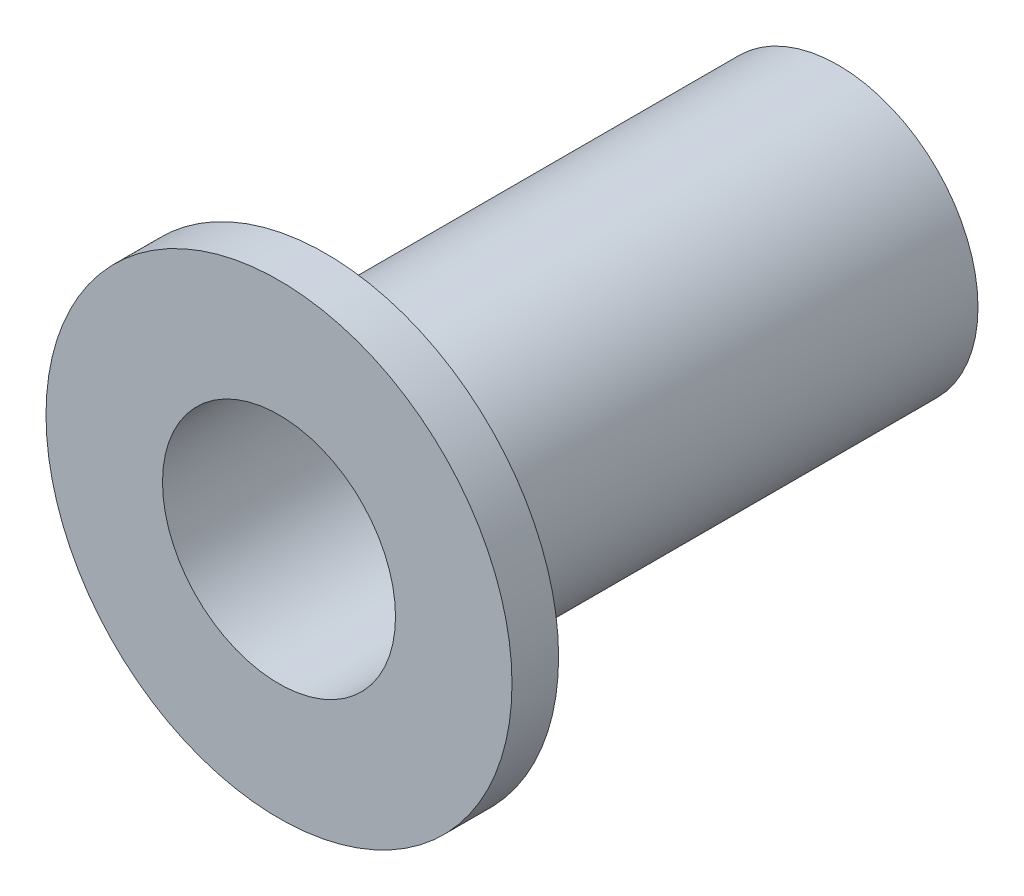
ISO-10303-21;
HEADER;
FILE_DESCRIPTION(('STEP AP214'),'2;1');
FILE_NAME('part.step','',(''),(''),'','','');
FILE_SCHEMA(('AUTOMOTIVE_DESIGN { 1 0 10303 214 1 1 1 1 }'));
ENDSEC;
DATA;
#1=APPLICATION_CONTEXT('core data for automotive mechanical design processes');
#2=APPLICATION_PROTOCOL_DEFINITION('international standard','automotive_design',2000,#1);
#3=PRODUCT_CONTEXT('',#1,'mechanical');
#4=PRODUCT('Part','Part','',(#3));
#5=PRODUCT_RELATED_PRODUCT_CATEGORY('part','',(#4));
#6=PRODUCT_DEFINITION_FORMATION('','',#4);
#7=PRODUCT_DEFINITION_CONTEXT('part definition',#1,'design');
#8=PRODUCT_DEFINITION('design','',#6,#7);
#9=PRODUCT_DEFINITION_SHAPE('','',#8);
#10=(LENGTH_UNIT() NAMED_UNIT(*) SI_UNIT(.MILLI.,.METRE.));
#11=(NAMED_UNIT(*) PLANE_ANGLE_UNIT() SI_UNIT($,.RADIAN.));
#12=(NAMED_UNIT(*) SI_UNIT($,.STERADIAN.) SOLID_ANGLE_UNIT());
#13=UNCERTAINTY_MEASURE_WITH_UNIT(LENGTH_MEASURE(1.E-05),#10,'distance_accuracy_value','');
#14=(GEOMETRIC_REPRESENTATION_CONTEXT(3) GLOBAL_UNCERTAINTY_ASSIGNED_CONTEXT((#13)) GLOBAL_UNIT_ASSIGNED_CONTEXT((#10,
#11,#12)) REPRESENTATION_CONTEXT('',''));
#15=CARTESIAN_POINT('',(0.,0.,0.));
#16=DIRECTION('',(0.,0.,1.));
#17=DIRECTION('',(1.,0.,0.));
#18=AXIS2_PLACEMENT_3D('',#15,#16,#17);
#19=CARTESIAN_POINT('',(0.,0.,6.));
#20=DIRECTION('',(0.,0.,-1.));
#21=DIRECTION('',(-1.,0.,0.));
#22=AXIS2_PLACEMENT_3D('',#19,#20,#21);
#23=CYLINDRICAL_SURFACE('',#22,1.5);
#24=CARTESIAN_POINT('',(0.,0.,0.));
#25=DIRECTION('',(0.,0.,1.));
#26=DIRECTION('',(1.,0.,0.));
#27=AXIS2_PLACEMENT_3D('',#24,#25,#26);
#28=CIRCLE('',#27,1.5);
#29=CARTESIAN_POINT('',(1.5,0.,0.));
#30=VERTEX_POINT('',#29);
#31=EDGE_CURVE('E33',#30,#30,#28,.T.);
#32=ORIENTED_EDGE('',*,*,#31,.T.);
#33=EDGE_LOOP('',(#32));
#34=FACE_BOUND('',#33,.T.);
#35=CARTESIAN_POINT('',(0.,0.,5.5));
#36=DIRECTION('',(0.,0.,1.));
#37=DIRECTION('',(1.,0.,0.));
#38=AXIS2_PLACEMENT_3D('',#35,#36,#37);
#39=CIRCLE('',#38,1.5);
#40=CARTESIAN_POINT('',(1.5,0.,5.5));
#41=VERTEX_POINT('',#40);
#42=EDGE_CURVE('E10',#41,#41,#39,.T.);
#43=ORIENTED_EDGE('',*,*,#42,.F.);
#44=EDGE_LOOP('',(#43));
#45=FACE_BOUND('',#44,.T.);
#46=ADVANCED_FACE('F30',(#34,#45),#23,.T.);
#47=CARTESIAN_POINT('',(0.,0.,6.));
#48=DIRECTION('',(0.,0.,1.));
#49=DIRECTION('',(1.,0.,0.));
#50=AXIS2_PLACEMENT_3D('',#47,#48,#49);
#51=PLANE('',#50);
#52=CARTESIAN_POINT('',(0.,0.,6.));
#53=DIRECTION('',(0.,0.,1.));
#54=DIRECTION('',(1.,0.,0.));
#55=AXIS2_PLACEMENT_3D('',#52,#53,#54);
#56=CIRCLE('',#55,1.25);
#57=CARTESIAN_POINT('',(1.25,0.,6.));
#58=VERTEX_POINT('',#57);
#59=EDGE_CURVE('E41',#58,#58,#56,.T.);
#60=ORIENTED_EDGE('',*,*,#59,.F.);
#61=EDGE_LOOP('',(#60));
#62=FACE_BOUND('',#61,.T.);
#63=CARTESIAN_POINT('',(0.,0.,6.));
#64=DIRECTION('',(0.,0.,1.));
#65=DIRECTION('',(1.,0.,0.));
#66=AXIS2_PLACEMENT_3D('',#63,#64,#65);
#67=CIRCLE('',#66,2.5);
#68=CARTESIAN_POINT('',(2.5,0.,6.));
#69=VERTEX_POINT('',#68);
#70=EDGE_CURVE('E44',#69,#69,#67,.T.);
#71=ORIENTED_EDGE('',*,*,#70,.T.);
#72=EDGE_LOOP('',(#71));
#73=FACE_BOUND('',#72,.T.);
#74=ADVANCED_FACE('F58',(#62,#73),#51,.T.);
#75=CARTESIAN_POINT('',(0.,0.,0.));
#76=DIRECTION('',(0.,0.,1.));
#77=DIRECTION('',(1.,0.,0.));
#78=AXIS2_PLACEMENT_3D('',#75,#76,#77);
#79=PLANE('',#78);
#80=ORIENTED_EDGE('',*,*,#31,.F.);
#81=EDGE_LOOP('',(#80));
#82=FACE_BOUND('',#81,.T.);
#83=CARTESIAN_POINT('',(0.,0.,0.));
#84=DIRECTION('',(0.,0.,1.));
#85=DIRECTION('',(1.,0.,0.));
#86=AXIS2_PLACEMENT_3D('',#83,#84,#85);
#87=CIRCLE('',#86,1.25);
#88=CARTESIAN_POINT('',(1.25,0.,0.));
#89=VERTEX_POINT('',#88);
#90=EDGE_CURVE('E47',#89,#89,#87,.T.);
#91=ORIENTED_EDGE('',*,*,#90,.T.);
#92=EDGE_LOOP('',(#91));
#93=FACE_BOUND('',#92,.T.);
#94=ADVANCED_FACE('F76',(#82,#93),#79,.F.);
#95=CARTESIAN_POINT('',(0.,0.,6.));
#96=DIRECTION('',(0.,0.,-1.));
#97=DIRECTION('',(-1.,0.,0.));
#98=AXIS2_PLACEMENT_3D('',#95,#96,#97);
#99=CYLINDRICAL_SURFACE('',#98,1.25);
#100=ORIENTED_EDGE('',*,*,#59,.T.);
#101=EDGE_LOOP('',(#100));
#102=FACE_BOUND('',#101,.T.);
#103=ORIENTED_EDGE('',*,*,#90,.F.);
#104=EDGE_LOOP('',(#103));
#105=FACE_BOUND('',#104,.T.);
#106=ADVANCED_FACE('F67',(#102,#105),#99,.F.);
#107=CARTESIAN_POINT('',(0.,0.,5.5));
#108=DIRECTION('',(0.,0.,1.));
#109=DIRECTION('',(1.,0.,0.));
#110=AXIS2_PLACEMENT_3D('',#107,#108,#109);
#111=PLANE('',#110);
#112=CARTESIAN_POINT('',(0.,0.,5.5));
#113=DIRECTION('',(0.,0.,1.));
#114=DIRECTION('',(1.,0.,0.));
#115=AXIS2_PLACEMENT_3D('',#112,#113,#114);
#116=CIRCLE('',#115,2.5);
#117=CARTESIAN_POINT('',(2.5,0.,5.5));
#118=VERTEX_POINT('',#117);
#119=EDGE_CURVE('E49',#118,#118,#116,.T.);
#120=ORIENTED_EDGE('',*,*,#119,.F.);
#121=EDGE_LOOP('',(#120));
#122=FACE_BOUND('',#121,.T.);
#123=ORIENTED_EDGE('',*,*,#42,.T.);
#124=EDGE_LOOP('',(#123));
#125=FACE_BOUND('',#124,.T.);
#126=ADVANCED_FACE('F62',(#122,#125),#111,.F.);
#127=CARTESIAN_POINT('',(0.,0.,5.5));
#128=DIRECTION('',(0.,0.,1.));
#129=DIRECTION('',(1.,0.,0.));
#130=AXIS2_PLACEMENT_3D('',#127,#128,#129);
#131=CYLINDRICAL_SURFACE('',#130,2.5);
#132=ORIENTED_EDGE('',*,*,#119,.T.);
#133=EDGE_LOOP('',(#132));
#134=FACE_BOUND('',#133,.T.);
#135=ORIENTED_EDGE('',*,*,#70,.F.);
#136=EDGE_LOOP('',(#135));
#137=FACE_BOUND('',#136,.T.);
#138=ADVANCED_FACE('F60',(#134,#137),#131,.T.);
#139=CLOSED_SHELL('',(#46,#74,#94,#106,#126,#138));
#140=MANIFOLD_SOLID_BREP('B2',#139);
#141=ADVANCED_BREP_SHAPE_REPRESENTATION('',(#18,#140),#14);
#142=SHAPE_DEFINITION_REPRESENTATION(#9,#141);
ENDSEC;
END-ISO-10303-21;
